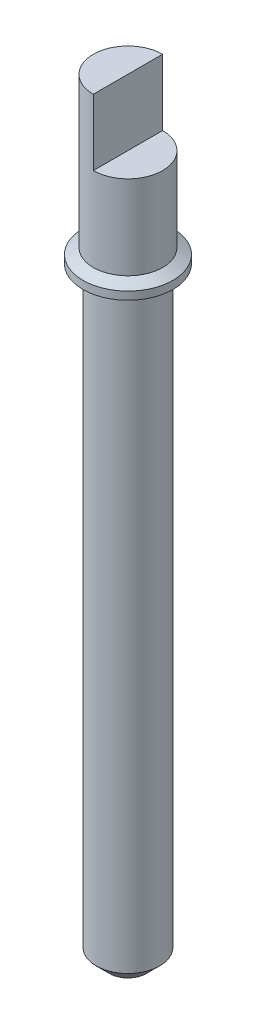
ISO-10303-21;
HEADER;
FILE_DESCRIPTION(('STEP AP214'),'2;1');
FILE_NAME('part.step','',(''),(''),'','','');
FILE_SCHEMA(('AUTOMOTIVE_DESIGN { 1 0 10303 214 1 1 1 1 }'));
ENDSEC;
DATA;
#1=APPLICATION_CONTEXT('core data for automotive mechanical design processes');
#2=APPLICATION_PROTOCOL_DEFINITION('international standard','automotive_design',2000,#1);
#3=PRODUCT_CONTEXT('',#1,'mechanical');
#4=PRODUCT('Part','Part','',(#3));
#5=PRODUCT_RELATED_PRODUCT_CATEGORY('part','',(#4));
#6=PRODUCT_DEFINITION_FORMATION('','',#4);
#7=PRODUCT_DEFINITION_CONTEXT('part definition',#1,'design');
#8=PRODUCT_DEFINITION('design','',#6,#7);
#9=PRODUCT_DEFINITION_SHAPE('','',#8);
#10=(LENGTH_UNIT() NAMED_UNIT(*) SI_UNIT(.MILLI.,.METRE.));
#11=(NAMED_UNIT(*) PLANE_ANGLE_UNIT() SI_UNIT($,.RADIAN.));
#12=(NAMED_UNIT(*) SI_UNIT($,.STERADIAN.) SOLID_ANGLE_UNIT());
#13=UNCERTAINTY_MEASURE_WITH_UNIT(LENGTH_MEASURE(1.E-05),#10,'distance_accuracy_value','');
#14=(GEOMETRIC_REPRESENTATION_CONTEXT(3) GLOBAL_UNCERTAINTY_ASSIGNED_CONTEXT((#13)) GLOBAL_UNIT_ASSIGNED_CONTEXT((#10,
#11,#12)) REPRESENTATION_CONTEXT('',''));
#15=CARTESIAN_POINT('',(0.,0.,0.));
#16=DIRECTION('',(0.,0.,1.));
#17=DIRECTION('',(1.,0.,0.));
#18=AXIS2_PLACEMENT_3D('',#15,#16,#17);
#19=CARTESIAN_POINT('',(0.,11.45,0.));
#20=DIRECTION('',(0.,-1.,0.));
#21=DIRECTION('',(0.,0.,-1.));
#22=AXIS2_PLACEMENT_3D('',#19,#20,#21);
#23=CYLINDRICAL_SURFACE('',#22,0.6);
#24=CARTESIAN_POINT('',(0.,11.306,0.));
#25=DIRECTION('',(0.,1.,0.));
#26=DIRECTION('',(0.,0.,1.));
#27=AXIS2_PLACEMENT_3D('',#24,#25,#26);
#28=CIRCLE('',#27,0.6);
#29=CARTESIAN_POINT('',(0.,11.306,0.599999999999998));
#30=VERTEX_POINT('',#29);
#31=EDGE_CURVE('E11',#30,#30,#28,.F.);
#32=ORIENTED_EDGE('',*,*,#31,.T.);
#33=EDGE_LOOP('',(#32));
#34=FACE_BOUND('',#33,.T.);
#35=CARTESIAN_POINT('',(0.,0.250000000000004,0.));
#36=DIRECTION('',(0.,1.,0.));
#37=DIRECTION('',(0.,0.,1.));
#38=AXIS2_PLACEMENT_3D('',#35,#36,#37);
#39=CIRCLE('',#38,0.6);
#40=CARTESIAN_POINT('',(0.,0.250000000000004,0.6));
#41=VERTEX_POINT('',#40);
#42=EDGE_CURVE('E86',#41,#41,#39,.T.);
#43=ORIENTED_EDGE('',*,*,#42,.T.);
#44=EDGE_LOOP('',(#43));
#45=FACE_BOUND('',#44,.T.);
#46=ADVANCED_FACE('F37',(#34,#45),#23,.T.);
#47=CARTESIAN_POINT('',(0.,0.,0.));
#48=DIRECTION('',(0.,1.,0.));
#49=DIRECTION('',(0.,0.,1.));
#50=AXIS2_PLACEMENT_3D('',#47,#48,#49);
#51=PLANE('',#50);
#52=CARTESIAN_POINT('',(0.,0.,0.));
#53=DIRECTION('',(0.,1.,0.));
#54=DIRECTION('',(0.,0.,1.));
#55=AXIS2_PLACEMENT_3D('',#52,#53,#54);
#56=CIRCLE('',#55,0.349999999999994);
#57=CARTESIAN_POINT('',(0.,0.,0.349999999999994));
#58=VERTEX_POINT('',#57);
#59=EDGE_CURVE('E69',#58,#58,#56,.F.);
#60=ORIENTED_EDGE('',*,*,#59,.T.);
#61=EDGE_LOOP('',(#60));
#62=FACE_BOUND('',#61,.T.);
#63=ADVANCED_FACE('F110',(#62),#51,.F.);
#64=CARTESIAN_POINT('',(0.,0.250000000000004,0.));
#65=DIRECTION('',(0.,1.,0.));
#66=DIRECTION('',(0.,0.,1.));
#67=AXIS2_PLACEMENT_3D('',#64,#65,#66);
#68=CONICAL_SURFACE('',#67,0.6,0.785398163397452);
#69=ORIENTED_EDGE('',*,*,#59,.F.);
#70=EDGE_LOOP('',(#69));
#71=FACE_BOUND('',#70,.T.);
#72=ORIENTED_EDGE('',*,*,#42,.F.);
#73=EDGE_LOOP('',(#72));
#74=FACE_BOUND('',#73,.T.);
#75=ADVANCED_FACE('F116',(#71,#74),#68,.T.);
#76=CARTESIAN_POINT('',(0.,11.6,0.));
#77=DIRECTION('',(0.,-1.,0.));
#78=DIRECTION('',(0.,0.,-1.));
#79=AXIS2_PLACEMENT_3D('',#76,#77,#78);
#80=CYLINDRICAL_SURFACE('',#79,0.85);
#81=CARTESIAN_POINT('',(0.,11.6,0.));
#82=DIRECTION('',(0.,1.,0.));
#83=DIRECTION('',(0.,0.,1.));
#84=AXIS2_PLACEMENT_3D('',#81,#82,#83);
#85=CIRCLE('',#84,0.85);
#86=CARTESIAN_POINT('',(0.,11.6,0.85));
#87=VERTEX_POINT('',#86);
#88=EDGE_CURVE('E81',#87,#87,#85,.T.);
#89=ORIENTED_EDGE('',*,*,#88,.F.);
#90=EDGE_LOOP('',(#89));
#91=FACE_BOUND('',#90,.T.);
#92=CARTESIAN_POINT('',(0.,11.45,0.));
#93=DIRECTION('',(0.,1.,0.));
#94=DIRECTION('',(0.,0.,1.));
#95=AXIS2_PLACEMENT_3D('',#92,#93,#94);
#96=CIRCLE('',#95,0.85);
#97=CARTESIAN_POINT('',(0.,11.45,0.85));
#98=VERTEX_POINT('',#97);
#99=EDGE_CURVE('E78',#98,#98,#96,.T.);
#100=ORIENTED_EDGE('',*,*,#99,.T.);
#101=EDGE_LOOP('',(#100));
#102=FACE_BOUND('',#101,.T.);
#103=ADVANCED_FACE('F123',(#91,#102),#80,.T.);
#104=CARTESIAN_POINT('',(0.,11.45,0.));
#105=DIRECTION('',(0.,1.,0.));
#106=DIRECTION('',(0.,0.,1.));
#107=AXIS2_PLACEMENT_3D('',#104,#105,#106);
#108=PLANE('',#107);
#109=CARTESIAN_POINT('',(0.,11.45,0.));
#110=DIRECTION('',(0.,1.,0.));
#111=DIRECTION('',(0.,0.,1.));
#112=AXIS2_PLACEMENT_3D('',#109,#110,#111);
#113=CIRCLE('',#112,0.849415316289921);
#114=CARTESIAN_POINT('',(0.,11.45,0.849415316289919));
#115=VERTEX_POINT('',#114);
#116=EDGE_CURVE('E45',#115,#115,#113,.T.);
#117=ORIENTED_EDGE('',*,*,#116,.T.);
#118=EDGE_LOOP('',(#117));
#119=FACE_BOUND('',#118,.T.);
#120=ORIENTED_EDGE('',*,*,#99,.F.);
#121=EDGE_LOOP('',(#120));
#122=FACE_BOUND('',#121,.T.);
#123=ADVANCED_FACE('F98',(#119,#122),#108,.F.);
#124=CARTESIAN_POINT('',(0.,14.55,0.));
#125=DIRECTION('',(0.,-1.,0.));
#126=DIRECTION('',(0.,0.,-1.));
#127=AXIS2_PLACEMENT_3D('',#124,#125,#126);
#128=CYLINDRICAL_SURFACE('',#127,0.655);
#129=CARTESIAN_POINT('',(0.,11.712583302492,0.));
#130=DIRECTION('',(0.,1.,0.));
#131=DIRECTION('',(0.,0.,1.));
#132=AXIS2_PLACEMENT_3D('',#129,#130,#131);
#133=CIRCLE('',#132,0.655);
#134=CARTESIAN_POINT('',(0.,11.712583302492,0.655));
#135=VERTEX_POINT('',#134);
#136=EDGE_CURVE('E93',#135,#135,#133,.T.);
#137=ORIENTED_EDGE('',*,*,#136,.T.);
#138=EDGE_LOOP('',(#137));
#139=FACE_BOUND('',#138,.T.);
#140=CARTESIAN_POINT('',(0.,14.55,0.));
#141=DIRECTION('',(0.,1.,0.));
#142=DIRECTION('',(0.,0.,1.));
#143=AXIS2_PLACEMENT_3D('',#140,#141,#142);
#144=CIRCLE('',#143,0.655);
#145=CARTESIAN_POINT('',(0.,14.55,-0.655));
#146=VERTEX_POINT('',#145);
#147=CARTESIAN_POINT('',(0.,14.55,0.654999999999999));
#148=VERTEX_POINT('',#147);
#149=EDGE_CURVE('E74',#146,#148,#144,.T.);
#150=ORIENTED_EDGE('',*,*,#149,.F.);
#151=DIRECTION('',(0.,-1.,0.));
#152=VECTOR('',#151,1.);
#153=CARTESIAN_POINT('',(0.,14.55,-0.655));
#154=LINE('',#153,#152);
#155=CARTESIAN_POINT('',(0.,13.3,-0.655));
#156=VERTEX_POINT('',#155);
#157=EDGE_CURVE('E52',#146,#156,#154,.T.);
#158=ORIENTED_EDGE('',*,*,#157,.T.);
#159=CARTESIAN_POINT('',(0.,13.3,0.));
#160=DIRECTION('',(0.,1.,0.));
#161=DIRECTION('',(0.,0.,1.));
#162=AXIS2_PLACEMENT_3D('',#159,#160,#161);
#163=CIRCLE('',#162,0.655);
#164=CARTESIAN_POINT('',(0.,13.3,0.655));
#165=VERTEX_POINT('',#164);
#166=EDGE_CURVE('E68',#165,#156,#163,.T.);
#167=ORIENTED_EDGE('',*,*,#166,.F.);
#168=DIRECTION('',(0.,-1.,0.));
#169=VECTOR('',#168,1.);
#170=CARTESIAN_POINT('',(0.,14.55,0.655));
#171=LINE('',#170,#169);
#172=EDGE_CURVE('E57',#165,#148,#171,.F.);
#173=ORIENTED_EDGE('',*,*,#172,.T.);
#174=EDGE_LOOP('',(#150,#158,#167,#173));
#175=FACE_BOUND('',#174,.T.);
#176=ADVANCED_FACE('F73',(#139,#175),#128,.T.);
#177=CARTESIAN_POINT('',(0.,14.55,0.));
#178=DIRECTION('',(0.,1.,0.));
#179=DIRECTION('',(0.,0.,1.));
#180=AXIS2_PLACEMENT_3D('',#177,#178,#179);
#181=PLANE('',#180);
#182=DIRECTION('',(0.,0.,1.));
#183=VECTOR('',#182,1.);
#184=CARTESIAN_POINT('',(0.,14.55,0.));
#185=LINE('',#184,#183);
#186=EDGE_CURVE('E63',#146,#148,#185,.T.);
#187=ORIENTED_EDGE('',*,*,#186,.F.);
#188=ORIENTED_EDGE('',*,*,#149,.T.);
#189=EDGE_LOOP('',(#187,#188));
#190=FACE_BOUND('',#189,.T.);
#191=ADVANCED_FACE('F77',(#190),#181,.T.);
#192=CARTESIAN_POINT('',(0.,13.3,0.));
#193=DIRECTION('',(0.,1.,0.));
#194=DIRECTION('',(0.,0.,1.));
#195=AXIS2_PLACEMENT_3D('',#192,#193,#194);
#196=PLANE('',#195);
#197=ORIENTED_EDGE('',*,*,#166,.T.);
#198=DIRECTION('',(0.,0.,1.));
#199=VECTOR('',#198,1.);
#200=CARTESIAN_POINT('',(0.,13.3,-0.919332156998797));
#201=LINE('',#200,#199);
#202=EDGE_CURVE('E75',#156,#165,#201,.T.);
#203=ORIENTED_EDGE('',*,*,#202,.T.);
#204=EDGE_LOOP('',(#197,#203));
#205=FACE_BOUND('',#204,.T.);
#206=ADVANCED_FACE('F144',(#205),#196,.T.);
#207=CARTESIAN_POINT('',(0.,13.3,-0.919332156998797));
#208=DIRECTION('',(-1.,0.,0.));
#209=DIRECTION('',(0.,0.,1.));
#210=AXIS2_PLACEMENT_3D('',#207,#208,#209);
#211=PLANE('',#210);
#212=ORIENTED_EDGE('',*,*,#186,.T.);
#213=ORIENTED_EDGE('',*,*,#172,.F.);
#214=ORIENTED_EDGE('',*,*,#202,.F.);
#215=ORIENTED_EDGE('',*,*,#157,.F.);
#216=EDGE_LOOP('',(#212,#213,#214,#215));
#217=FACE_BOUND('',#216,.T.);
#218=ADVANCED_FACE('F64',(#217),#211,.F.);
#219=CARTESIAN_POINT('',(0.,11.712583302492,0.));
#220=DIRECTION('',(0.,-1.,0.));
#221=DIRECTION('',(0.,0.,-1.));
#222=AXIS2_PLACEMENT_3D('',#219,#220,#221);
#223=CONICAL_SURFACE('',#222,0.655,1.04719755119659);
#224=ORIENTED_EDGE('',*,*,#88,.T.);
#225=EDGE_LOOP('',(#224));
#226=FACE_BOUND('',#225,.T.);
#227=ORIENTED_EDGE('',*,*,#136,.F.);
#228=EDGE_LOOP('',(#227));
#229=FACE_BOUND('',#228,.T.);
#230=ADVANCED_FACE('F102',(#226,#229),#223,.T.);
#231=CARTESIAN_POINT('',(0.,11.45,0.));
#232=DIRECTION('',(0.,1.,0.));
#233=DIRECTION('',(0.,0.,1.));
#234=AXIS2_PLACEMENT_3D('',#231,#232,#233);
#235=CONICAL_SURFACE('',#234,0.849415316289921,1.04719755119661);
#236=CARTESIAN_POINT('',(0.,11.306,0.599999999999998));
#237=CARTESIAN_POINT('',(0.,11.3075,0.602598076211351));
#238=CARTESIAN_POINT('',(0.,11.309,0.605196152422705));
#239=CARTESIAN_POINT('',(0.,11.312,0.610392304845412));
#240=CARTESIAN_POINT('',(0.,11.3135,0.612990381056765));
#241=CARTESIAN_POINT('',(0.,11.3165,0.618186533479472));
#242=CARTESIAN_POINT('',(0.,11.318,0.620784609690825));
#243=CARTESIAN_POINT('',(0.,11.321,0.625980762113531));
#244=CARTESIAN_POINT('',(0.,11.3225,0.628578838324885));
#245=CARTESIAN_POINT('',(0.,11.3255,0.633774990747592));
#246=CARTESIAN_POINT('',(0.,11.327,0.636373066958945));
#247=CARTESIAN_POINT('',(0.,11.33,0.641569219381652));
#248=CARTESIAN_POINT('',(0.,11.3315,0.644167295593005));
#249=CARTESIAN_POINT('',(0.,11.3345,0.649363448015712));
#250=CARTESIAN_POINT('',(0.,11.336,0.651961524227065));
#251=CARTESIAN_POINT('',(0.,11.339,0.657157676649772));
#252=CARTESIAN_POINT('',(0.,11.3405,0.659755752861125));
#253=CARTESIAN_POINT('',(0.,11.3435,0.664951905283832));
#254=CARTESIAN_POINT('',(0.,11.345,0.667549981495185));
#255=CARTESIAN_POINT('',(0.,11.348,0.672746133917892));
#256=CARTESIAN_POINT('',(0.,11.3495,0.675344210129245));
#257=CARTESIAN_POINT('',(0.,11.3525,0.680540362551952));
#258=CARTESIAN_POINT('',(0.,11.354,0.683138438763305));
#259=CARTESIAN_POINT('',(0.,11.357,0.688334591186012));
#260=CARTESIAN_POINT('',(0.,11.3585,0.690932667397365));
#261=CARTESIAN_POINT('',(0.,11.3615,0.696128819820072));
#262=CARTESIAN_POINT('',(0.,11.363,0.698726896031425));
#263=CARTESIAN_POINT('',(0.,11.366,0.703923048454132));
#264=CARTESIAN_POINT('',(0.,11.3675,0.706521124665485));
#265=CARTESIAN_POINT('',(0.,11.3705,0.711717277088192));
#266=CARTESIAN_POINT('',(0.,11.372,0.714315353299545));
#267=CARTESIAN_POINT('',(0.,11.375,0.719511505722252));
#268=CARTESIAN_POINT('',(0.,11.3765,0.722109581933605));
#269=CARTESIAN_POINT('',(0.,11.3795,0.727305734356312));
#270=CARTESIAN_POINT('',(0.,11.381,0.729903810567665));
#271=CARTESIAN_POINT('',(0.,11.384,0.735099962990372));
#272=CARTESIAN_POINT('',(0.,11.3855,0.737698039201726));
#273=CARTESIAN_POINT('',(0.,11.3885,0.742894191624432));
#274=CARTESIAN_POINT('',(0.,11.39,0.745492267835785));
#275=CARTESIAN_POINT('',(0.,11.393,0.750688420258492));
#276=CARTESIAN_POINT('',(0.,11.3945,0.753286496469845));
#277=CARTESIAN_POINT('',(0.,11.3975,0.758482648892552));
#278=CARTESIAN_POINT('',(0.,11.399,0.761080725103906));
#279=CARTESIAN_POINT('',(0.,11.402,0.766276877526612));
#280=CARTESIAN_POINT('',(0.,11.4035,0.768874953737965));
#281=CARTESIAN_POINT('',(0.,11.4065,0.774071106160672));
#282=CARTESIAN_POINT('',(0.,11.408,0.776669182372026));
#283=CARTESIAN_POINT('',(0.,11.411,0.781865334794732));
#284=CARTESIAN_POINT('',(0.,11.4125,0.784463411006085));
#285=CARTESIAN_POINT('',(0.,11.4155,0.789659563428792));
#286=CARTESIAN_POINT('',(0.,11.417,0.792257639640145));
#287=CARTESIAN_POINT('',(0.,11.42,0.797453792062852));
#288=CARTESIAN_POINT('',(0.,11.4215,0.800051868274206));
#289=CARTESIAN_POINT('',(0.,11.4245,0.805248020696912));
#290=CARTESIAN_POINT('',(0.,11.426,0.807846096908265));
#291=CARTESIAN_POINT('',(0.,11.429,0.813042249330972));
#292=CARTESIAN_POINT('',(0.,11.4305,0.815640325542325));
#293=CARTESIAN_POINT('',(0.,11.4335,0.820836477965032));
#294=CARTESIAN_POINT('',(0.,11.435,0.823434554176386));
#295=CARTESIAN_POINT('',(0.,11.438,0.828630706599092));
#296=CARTESIAN_POINT('',(0.,11.4395,0.831228782810446));
#297=CARTESIAN_POINT('',(0.,11.4425,0.836424935233152));
#298=CARTESIAN_POINT('',(0.,11.444,0.839023011444506));
#299=CARTESIAN_POINT('',(0.,11.447,0.844219163867213));
#300=CARTESIAN_POINT('',(0.,11.4485,0.846817240078566));
#301=CARTESIAN_POINT('',(0.,11.45,0.849415316289919));
#302=B_SPLINE_CURVE_WITH_KNOTS('',3,(#236,#237,#238,#239,#240,#241,#242,#243,#244,#245,#246,
#247,#248,#249,#250,#251,#252,#253,#254,#255,#256,#257,#258,#259,#260,#261,#262,#263,#264,#265,
#266,#267,#268,#269,#270,#271,#272,#273,#274,#275,#276,#277,#278,#279,#280,#281,#282,#283,#284,
#285,#286,#287,#288,#289,#290,#291,#292,#293,#294,#295,#296,#297,#298,#299,#300,#301),
.UNSPECIFIED.,.F.,.F.,(4,2,2,2,2,2,2,2,2,2,2,2,2,2,2,2,2,2,2,2,2,2,2,2,2,2,2,2,2,2,2,2,4),(0.,
0.00899999999999971,0.0179999999999994,0.027,0.0359999999999997,0.0449999999999994,0.054,
0.0629999999999997,0.0720000000000003,0.081,0.0899999999999997,0.0990000000000003,0.108,0.117,
0.126,0.135,0.144000000000001,0.153,0.162,0.171000000000001,0.18,0.189,0.198000000000001,0.207,
0.216000000000001,0.225000000000001,0.234,0.243000000000001,0.252000000000001,0.261,
0.270000000000001,0.279000000000001,0.288000000000001),.UNSPECIFIED.);
#303=EDGE_CURVE('BSEAM39',#30,#115,#302,.T.);
#304=ORIENTED_EDGE('',*,*,#31,.F.);
#305=ORIENTED_EDGE('',*,*,#116,.F.);
#306=ORIENTED_EDGE('',*,*,#303,.T.);
#307=ORIENTED_EDGE('',*,*,#303,.F.);
#308=EDGE_LOOP('',(#304,#306,#305,#307));
#309=FACE_BOUND('',#308,.T.);
#310=ADVANCED_FACE('F39',(#309),#235,.T.);
#311=CLOSED_SHELL('',(#46,#63,#75,#103,#123,#176,#191,#206,#218,#230,#310));
#312=MANIFOLD_SOLID_BREP('B2',#311);
#313=ADVANCED_BREP_SHAPE_REPRESENTATION('',(#18,#312),#14);
#314=SHAPE_DEFINITION_REPRESENTATION(#9,#313);
ENDSEC;
END-ISO-10303-21;
